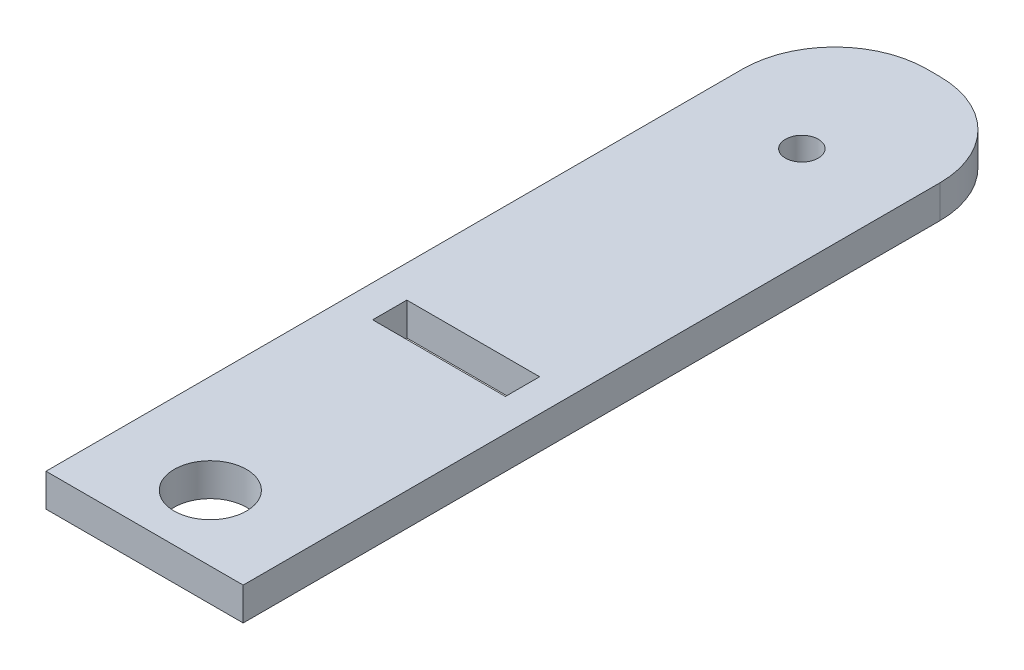
ISO-10303-21;
HEADER;
FILE_DESCRIPTION(('STEP AP214'),'2;1');
FILE_NAME('part.step','',(''),(''),'','','');
FILE_SCHEMA(('AUTOMOTIVE_DESIGN { 1 0 10303 214 1 1 1 1 }'));
ENDSEC;
DATA;
#1=APPLICATION_CONTEXT('core data for automotive mechanical design processes');
#2=APPLICATION_PROTOCOL_DEFINITION('international standard','automotive_design',2000,#1);
#3=PRODUCT_CONTEXT('',#1,'mechanical');
#4=PRODUCT('Part','Part','',(#3));
#5=PRODUCT_RELATED_PRODUCT_CATEGORY('part','',(#4));
#6=PRODUCT_DEFINITION_FORMATION('','',#4);
#7=PRODUCT_DEFINITION_CONTEXT('part definition',#1,'design');
#8=PRODUCT_DEFINITION('design','',#6,#7);
#9=PRODUCT_DEFINITION_SHAPE('','',#8);
#10=(LENGTH_UNIT() NAMED_UNIT(*) SI_UNIT(.MILLI.,.METRE.));
#11=(NAMED_UNIT(*) PLANE_ANGLE_UNIT() SI_UNIT($,.RADIAN.));
#12=(NAMED_UNIT(*) SI_UNIT($,.STERADIAN.) SOLID_ANGLE_UNIT());
#13=UNCERTAINTY_MEASURE_WITH_UNIT(LENGTH_MEASURE(1.E-05),#10,'distance_accuracy_value','');
#14=(GEOMETRIC_REPRESENTATION_CONTEXT(3) GLOBAL_UNCERTAINTY_ASSIGNED_CONTEXT((#13)) GLOBAL_UNIT_ASSIGNED_CONTEXT((#10,
#11,#12)) REPRESENTATION_CONTEXT('',''));
#15=CARTESIAN_POINT('',(0.,0.,0.));
#16=DIRECTION('',(0.,0.,1.));
#17=DIRECTION('',(1.,0.,0.));
#18=AXIS2_PLACEMENT_3D('',#15,#16,#17);
#19=CARTESIAN_POINT('',(-0.635000000000002,3.175,-29.21));
#20=DIRECTION('',(0.,-1.,0.));
#21=DIRECTION('',(0.,0.,-1.));
#22=AXIS2_PLACEMENT_3D('',#19,#20,#21);
#23=CYLINDRICAL_SURFACE('',#22,8.89);
#24=DIRECTION('',(0.,-1.,0.));
#25=VECTOR('',#24,1.);
#26=CARTESIAN_POINT('',(-9.525,3.175,-29.21));
#27=LINE('',#26,#25);
#28=CARTESIAN_POINT('',(-9.525,3.175,-29.21));
#29=VERTEX_POINT('',#28);
#30=CARTESIAN_POINT('',(-9.525,0.,-29.21));
#31=VERTEX_POINT('',#30);
#32=EDGE_CURVE('E197',#29,#31,#27,.T.);
#33=ORIENTED_EDGE('',*,*,#32,.F.);
#34=CARTESIAN_POINT('',(-0.635000000000002,3.175,-29.21));
#35=DIRECTION('',(0.,1.,0.));
#36=DIRECTION('',(0.,0.,1.));
#37=AXIS2_PLACEMENT_3D('',#34,#35,#36);
#38=CIRCLE('',#37,8.89);
#39=CARTESIAN_POINT('',(-0.635000000000005,3.175,-38.1));
#40=VERTEX_POINT('',#39);
#41=EDGE_CURVE('E40',#40,#29,#38,.T.);
#42=ORIENTED_EDGE('',*,*,#41,.F.);
#43=DIRECTION('',(0.,-1.,0.));
#44=VECTOR('',#43,1.);
#45=CARTESIAN_POINT('',(-0.635000000000002,3.175,-38.1));
#46=LINE('',#45,#44);
#47=CARTESIAN_POINT('',(-0.635000000000005,0.,-38.1));
#48=VERTEX_POINT('',#47);
#49=EDGE_CURVE('E200',#48,#40,#46,.F.);
#50=ORIENTED_EDGE('',*,*,#49,.F.);
#51=CARTESIAN_POINT('',(-0.635000000000002,0.,-29.21));
#52=DIRECTION('',(0.,1.,0.));
#53=DIRECTION('',(0.,0.,1.));
#54=AXIS2_PLACEMENT_3D('',#51,#52,#53);
#55=CIRCLE('',#54,8.89);
#56=EDGE_CURVE('E11',#31,#48,#55,.F.);
#57=ORIENTED_EDGE('',*,*,#56,.F.);
#58=EDGE_LOOP('',(#33,#42,#50,#57));
#59=FACE_BOUND('',#58,.T.);
#60=ADVANCED_FACE('F33',(#59),#23,.T.);
#61=CARTESIAN_POINT('',(0.635000000000003,3.175,-29.21));
#62=DIRECTION('',(0.,1.,0.));
#63=DIRECTION('',(0.,0.,1.));
#64=AXIS2_PLACEMENT_3D('',#61,#62,#63);
#65=CYLINDRICAL_SURFACE('',#64,8.89);
#66=DIRECTION('',(0.,1.,0.));
#67=VECTOR('',#66,1.);
#68=CARTESIAN_POINT('',(9.525,3.175,-29.21));
#69=LINE('',#68,#67);
#70=CARTESIAN_POINT('',(9.525,0.,-29.21));
#71=VERTEX_POINT('',#70);
#72=CARTESIAN_POINT('',(9.525,3.175,-29.21));
#73=VERTEX_POINT('',#72);
#74=EDGE_CURVE('E187',#71,#73,#69,.T.);
#75=ORIENTED_EDGE('',*,*,#74,.F.);
#76=CARTESIAN_POINT('',(0.635000000000003,0.,-29.21));
#77=DIRECTION('',(0.,1.,0.));
#78=DIRECTION('',(0.,0.,1.));
#79=AXIS2_PLACEMENT_3D('',#76,#77,#78);
#80=CIRCLE('',#79,8.89);
#81=CARTESIAN_POINT('',(0.634999999999998,0.,-38.1));
#82=VERTEX_POINT('',#81);
#83=EDGE_CURVE('E193',#82,#71,#80,.F.);
#84=ORIENTED_EDGE('',*,*,#83,.F.);
#85=DIRECTION('',(0.,1.,0.));
#86=VECTOR('',#85,1.);
#87=CARTESIAN_POINT('',(0.635000000000002,3.175,-38.1));
#88=LINE('',#87,#86);
#89=CARTESIAN_POINT('',(0.634999999999998,3.175,-38.1));
#90=VERTEX_POINT('',#89);
#91=EDGE_CURVE('E190',#90,#82,#88,.F.);
#92=ORIENTED_EDGE('',*,*,#91,.F.);
#93=CARTESIAN_POINT('',(0.635000000000003,3.175,-29.21));
#94=DIRECTION('',(0.,1.,0.));
#95=DIRECTION('',(0.,0.,1.));
#96=AXIS2_PLACEMENT_3D('',#93,#94,#95);
#97=CIRCLE('',#96,8.89);
#98=EDGE_CURVE('E195',#73,#90,#97,.T.);
#99=ORIENTED_EDGE('',*,*,#98,.F.);
#100=EDGE_LOOP('',(#75,#84,#92,#99));
#101=FACE_BOUND('',#100,.T.);
#102=ADVANCED_FACE('F220',(#101),#65,.T.);
#103=CARTESIAN_POINT('',(0.,3.175,0.));
#104=DIRECTION('',(0.,1.,0.));
#105=DIRECTION('',(0.,0.,1.));
#106=AXIS2_PLACEMENT_3D('',#103,#104,#105);
#107=PLANE('',#106);
#108=CARTESIAN_POINT('',(0.,3.175,31.75));
#109=DIRECTION('',(0.,1.,0.));
#110=DIRECTION('',(0.,0.,1.));
#111=AXIS2_PLACEMENT_3D('',#108,#109,#110);
#112=CIRCLE('',#111,3.4925);
#113=CARTESIAN_POINT('',(0.,3.175,35.2425));
#114=VERTEX_POINT('',#113);
#115=EDGE_CURVE('E150',#114,#114,#112,.T.);
#116=ORIENTED_EDGE('',*,*,#115,.F.);
#117=EDGE_LOOP('',(#116));
#118=FACE_BOUND('',#117,.T.);
#119=DIRECTION('',(-1.,0.,0.));
#120=VECTOR('',#119,1.);
#121=CARTESIAN_POINT('',(-9.525,3.175,-38.1));
#122=LINE('',#121,#120);
#123=EDGE_CURVE('E170',#90,#40,#122,.T.);
#124=ORIENTED_EDGE('',*,*,#123,.T.);
#125=ORIENTED_EDGE('',*,*,#41,.T.);
#126=DIRECTION('',(0.,0.,1.));
#127=VECTOR('',#126,1.);
#128=CARTESIAN_POINT('',(-9.525,3.175,-38.1));
#129=LINE('',#128,#127);
#130=CARTESIAN_POINT('',(-9.525,3.175,38.1));
#131=VERTEX_POINT('',#130);
#132=EDGE_CURVE('E162',#29,#131,#129,.T.);
#133=ORIENTED_EDGE('',*,*,#132,.T.);
#134=DIRECTION('',(1.,0.,0.));
#135=VECTOR('',#134,1.);
#136=CARTESIAN_POINT('',(-9.525,3.175,38.1));
#137=LINE('',#136,#135);
#138=CARTESIAN_POINT('',(9.52500000000001,3.175,38.1));
#139=VERTEX_POINT('',#138);
#140=EDGE_CURVE('E164',#131,#139,#137,.T.);
#141=ORIENTED_EDGE('',*,*,#140,.T.);
#142=DIRECTION('',(0.,0.,-1.));
#143=VECTOR('',#142,1.);
#144=CARTESIAN_POINT('',(9.525,3.175,-38.1));
#145=LINE('',#144,#143);
#146=EDGE_CURVE('E167',#139,#73,#145,.T.);
#147=ORIENTED_EDGE('',*,*,#146,.T.);
#148=ORIENTED_EDGE('',*,*,#98,.T.);
#149=EDGE_LOOP('',(#124,#125,#133,#141,#147,#148));
#150=FACE_BOUND('',#149,.T.);
#151=CARTESIAN_POINT('',(0.,3.175,-25.4));
#152=DIRECTION('',(0.,1.,0.));
#153=DIRECTION('',(0.,0.,1.));
#154=AXIS2_PLACEMENT_3D('',#151,#152,#153);
#155=CIRCLE('',#154,1.5875);
#156=CARTESIAN_POINT('',(0.,3.175,-23.8125));
#157=VERTEX_POINT('',#156);
#158=EDGE_CURVE('E156',#157,#157,#155,.T.);
#159=ORIENTED_EDGE('',*,*,#158,.F.);
#160=EDGE_LOOP('',(#159));
#161=FACE_BOUND('',#160,.T.);
#162=DIRECTION('',(1.,0.,0.));
#163=VECTOR('',#162,1.);
#164=CARTESIAN_POINT('',(-6.4135,3.175,9.652));
#165=LINE('',#164,#163);
#166=CARTESIAN_POINT('',(-6.4135,3.175,9.652));
#167=VERTEX_POINT('',#166);
#168=CARTESIAN_POINT('',(6.4135,3.175,9.652));
#169=VERTEX_POINT('',#168);
#170=EDGE_CURVE('E118',#167,#169,#165,.T.);
#171=ORIENTED_EDGE('',*,*,#170,.F.);
#172=DIRECTION('',(0.,0.,1.));
#173=VECTOR('',#172,1.);
#174=CARTESIAN_POINT('',(-6.4135,3.175,6.35));
#175=LINE('',#174,#173);
#176=CARTESIAN_POINT('',(-6.4135,3.175,6.35));
#177=VERTEX_POINT('',#176);
#178=EDGE_CURVE('E108',#177,#167,#175,.T.);
#179=ORIENTED_EDGE('',*,*,#178,.F.);
#180=DIRECTION('',(-1.,0.,0.));
#181=VECTOR('',#180,1.);
#182=CARTESIAN_POINT('',(-6.4135,3.175,6.35));
#183=LINE('',#182,#181);
#184=CARTESIAN_POINT('',(6.4135,3.175,6.35));
#185=VERTEX_POINT('',#184);
#186=EDGE_CURVE('E134',#185,#177,#183,.T.);
#187=ORIENTED_EDGE('',*,*,#186,.F.);
#188=DIRECTION('',(0.,0.,-1.));
#189=VECTOR('',#188,1.);
#190=CARTESIAN_POINT('',(6.4135,3.175,6.35));
#191=LINE('',#190,#189);
#192=EDGE_CURVE('E132',#169,#185,#191,.T.);
#193=ORIENTED_EDGE('',*,*,#192,.F.);
#194=EDGE_LOOP('',(#171,#179,#187,#193));
#195=FACE_BOUND('',#194,.T.);
#196=ADVANCED_FACE('F130',(#118,#150,#161,#195),#107,.T.);
#197=CARTESIAN_POINT('',(0.,0.,0.));
#198=DIRECTION('',(0.,1.,0.));
#199=DIRECTION('',(0.,0.,1.));
#200=AXIS2_PLACEMENT_3D('',#197,#198,#199);
#201=PLANE('',#200);
#202=CARTESIAN_POINT('',(0.,0.,31.75));
#203=DIRECTION('',(0.,1.,0.));
#204=DIRECTION('',(0.,0.,1.));
#205=AXIS2_PLACEMENT_3D('',#202,#203,#204);
#206=CIRCLE('',#205,3.4925);
#207=CARTESIAN_POINT('',(0.,0.,35.2425));
#208=VERTEX_POINT('',#207);
#209=EDGE_CURVE('E126',#208,#208,#206,.T.);
#210=ORIENTED_EDGE('',*,*,#209,.T.);
#211=EDGE_LOOP('',(#210));
#212=FACE_BOUND('',#211,.T.);
#213=DIRECTION('',(0.,0.,1.));
#214=VECTOR('',#213,1.);
#215=CARTESIAN_POINT('',(-9.525,0.,-38.1));
#216=LINE('',#215,#214);
#217=CARTESIAN_POINT('',(-9.525,0.,38.1));
#218=VERTEX_POINT('',#217);
#219=EDGE_CURVE('E159',#31,#218,#216,.T.);
#220=ORIENTED_EDGE('',*,*,#219,.F.);
#221=ORIENTED_EDGE('',*,*,#56,.T.);
#222=DIRECTION('',(-1.,0.,0.));
#223=VECTOR('',#222,1.);
#224=CARTESIAN_POINT('',(-9.525,0.,-38.1));
#225=LINE('',#224,#223);
#226=EDGE_CURVE('E165',#82,#48,#225,.T.);
#227=ORIENTED_EDGE('',*,*,#226,.F.);
#228=ORIENTED_EDGE('',*,*,#83,.T.);
#229=DIRECTION('',(0.,0.,-1.));
#230=VECTOR('',#229,1.);
#231=CARTESIAN_POINT('',(9.525,0.,-38.1));
#232=LINE('',#231,#230);
#233=CARTESIAN_POINT('',(9.52500000000001,0.,38.1));
#234=VERTEX_POINT('',#233);
#235=EDGE_CURVE('E177',#234,#71,#232,.T.);
#236=ORIENTED_EDGE('',*,*,#235,.F.);
#237=DIRECTION('',(1.,0.,0.));
#238=VECTOR('',#237,1.);
#239=CARTESIAN_POINT('',(-9.525,0.,38.1));
#240=LINE('',#239,#238);
#241=EDGE_CURVE('E175',#218,#234,#240,.T.);
#242=ORIENTED_EDGE('',*,*,#241,.F.);
#243=EDGE_LOOP('',(#220,#221,#227,#228,#236,#242));
#244=FACE_BOUND('',#243,.T.);
#245=CARTESIAN_POINT('',(0.,0.,-25.4));
#246=DIRECTION('',(0.,1.,0.));
#247=DIRECTION('',(0.,0.,1.));
#248=AXIS2_PLACEMENT_3D('',#245,#246,#247);
#249=CIRCLE('',#248,1.5875);
#250=CARTESIAN_POINT('',(0.,0.,-23.8125));
#251=VERTEX_POINT('',#250);
#252=EDGE_CURVE('E153',#251,#251,#249,.T.);
#253=ORIENTED_EDGE('',*,*,#252,.T.);
#254=EDGE_LOOP('',(#253));
#255=FACE_BOUND('',#254,.T.);
#256=DIRECTION('',(0.,0.,1.));
#257=VECTOR('',#256,1.);
#258=CARTESIAN_POINT('',(-6.4135,0.,6.35));
#259=LINE('',#258,#257);
#260=CARTESIAN_POINT('',(-6.4135,0.,6.35));
#261=VERTEX_POINT('',#260);
#262=CARTESIAN_POINT('',(-6.4135,0.,9.652));
#263=VERTEX_POINT('',#262);
#264=EDGE_CURVE('E138',#261,#263,#259,.T.);
#265=ORIENTED_EDGE('',*,*,#264,.T.);
#266=DIRECTION('',(1.,0.,0.));
#267=VECTOR('',#266,1.);
#268=CARTESIAN_POINT('',(-6.4135,0.,9.652));
#269=LINE('',#268,#267);
#270=CARTESIAN_POINT('',(6.4135,0.,9.652));
#271=VERTEX_POINT('',#270);
#272=EDGE_CURVE('E125',#263,#271,#269,.T.);
#273=ORIENTED_EDGE('',*,*,#272,.T.);
#274=DIRECTION('',(0.,0.,-1.));
#275=VECTOR('',#274,1.);
#276=CARTESIAN_POINT('',(6.4135,0.,6.35));
#277=LINE('',#276,#275);
#278=CARTESIAN_POINT('',(6.4135,0.,6.35));
#279=VERTEX_POINT('',#278);
#280=EDGE_CURVE('E141',#271,#279,#277,.T.);
#281=ORIENTED_EDGE('',*,*,#280,.T.);
#282=DIRECTION('',(-1.,0.,0.));
#283=VECTOR('',#282,1.);
#284=CARTESIAN_POINT('',(-6.4135,0.,6.35));
#285=LINE('',#284,#283);
#286=EDGE_CURVE('E119',#279,#261,#285,.T.);
#287=ORIENTED_EDGE('',*,*,#286,.T.);
#288=EDGE_LOOP('',(#265,#273,#281,#287));
#289=FACE_BOUND('',#288,.T.);
#290=ADVANCED_FACE('F223',(#212,#244,#255,#289),#201,.F.);
#291=CARTESIAN_POINT('',(-9.525,3.175,-38.1));
#292=DIRECTION('',(1.,0.,0.));
#293=DIRECTION('',(0.,0.,-1.));
#294=AXIS2_PLACEMENT_3D('',#291,#292,#293);
#295=PLANE('',#294);
#296=ORIENTED_EDGE('',*,*,#132,.F.);
#297=ORIENTED_EDGE('',*,*,#32,.T.);
#298=ORIENTED_EDGE('',*,*,#219,.T.);
#299=DIRECTION('',(0.,-1.,0.));
#300=VECTOR('',#299,1.);
#301=CARTESIAN_POINT('',(-9.525,3.175,38.1));
#302=LINE('',#301,#300);
#303=EDGE_CURVE('E184',#131,#218,#302,.T.);
#304=ORIENTED_EDGE('',*,*,#303,.F.);
#305=EDGE_LOOP('',(#296,#297,#298,#304));
#306=FACE_BOUND('',#305,.T.);
#307=ADVANCED_FACE('F208',(#306),#295,.F.);
#308=CARTESIAN_POINT('',(-9.525,3.175,38.1));
#309=DIRECTION('',(0.,0.,-1.));
#310=DIRECTION('',(-1.,0.,0.));
#311=AXIS2_PLACEMENT_3D('',#308,#309,#310);
#312=PLANE('',#311);
#313=ORIENTED_EDGE('',*,*,#241,.T.);
#314=DIRECTION('',(0.,-1.,0.));
#315=VECTOR('',#314,1.);
#316=CARTESIAN_POINT('',(9.52500000000001,3.175,38.1));
#317=LINE('',#316,#315);
#318=EDGE_CURVE('E173',#139,#234,#317,.T.);
#319=ORIENTED_EDGE('',*,*,#318,.F.);
#320=ORIENTED_EDGE('',*,*,#140,.F.);
#321=ORIENTED_EDGE('',*,*,#303,.T.);
#322=EDGE_LOOP('',(#313,#319,#320,#321));
#323=FACE_BOUND('',#322,.T.);
#324=ADVANCED_FACE('F211',(#323),#312,.F.);
#325=CARTESIAN_POINT('',(9.525,3.175,-38.1));
#326=DIRECTION('',(-1.,0.,0.));
#327=DIRECTION('',(0.,0.,1.));
#328=AXIS2_PLACEMENT_3D('',#325,#326,#327);
#329=PLANE('',#328);
#330=ORIENTED_EDGE('',*,*,#235,.T.);
#331=ORIENTED_EDGE('',*,*,#74,.T.);
#332=ORIENTED_EDGE('',*,*,#146,.F.);
#333=ORIENTED_EDGE('',*,*,#318,.T.);
#334=EDGE_LOOP('',(#330,#331,#332,#333));
#335=FACE_BOUND('',#334,.T.);
#336=ADVANCED_FACE('F216',(#335),#329,.F.);
#337=CARTESIAN_POINT('',(-9.525,3.175,-38.1));
#338=DIRECTION('',(0.,0.,1.));
#339=DIRECTION('',(1.,0.,0.));
#340=AXIS2_PLACEMENT_3D('',#337,#338,#339);
#341=PLANE('',#340);
#342=ORIENTED_EDGE('',*,*,#226,.T.);
#343=ORIENTED_EDGE('',*,*,#49,.T.);
#344=ORIENTED_EDGE('',*,*,#123,.F.);
#345=ORIENTED_EDGE('',*,*,#91,.T.);
#346=EDGE_LOOP('',(#342,#343,#344,#345));
#347=FACE_BOUND('',#346,.T.);
#348=ADVANCED_FACE('F222',(#347),#341,.F.);
#349=CARTESIAN_POINT('',(0.,3.175,-25.4));
#350=DIRECTION('',(0.,-1.,0.));
#351=DIRECTION('',(0.,0.,-1.));
#352=AXIS2_PLACEMENT_3D('',#349,#350,#351);
#353=CYLINDRICAL_SURFACE('',#352,1.5875);
#354=ORIENTED_EDGE('',*,*,#158,.T.);
#355=EDGE_LOOP('',(#354));
#356=FACE_BOUND('',#355,.T.);
#357=ORIENTED_EDGE('',*,*,#252,.F.);
#358=EDGE_LOOP('',(#357));
#359=FACE_BOUND('',#358,.T.);
#360=ADVANCED_FACE('F261',(#356,#359),#353,.F.);
#361=CARTESIAN_POINT('',(0.,3.175,31.75));
#362=DIRECTION('',(0.,-1.,0.));
#363=DIRECTION('',(0.,0.,-1.));
#364=AXIS2_PLACEMENT_3D('',#361,#362,#363);
#365=CYLINDRICAL_SURFACE('',#364,3.4925);
#366=ORIENTED_EDGE('',*,*,#115,.T.);
#367=EDGE_LOOP('',(#366));
#368=FACE_BOUND('',#367,.T.);
#369=ORIENTED_EDGE('',*,*,#209,.F.);
#370=EDGE_LOOP('',(#369));
#371=FACE_BOUND('',#370,.T.);
#372=ADVANCED_FACE('F265',(#368,#371),#365,.F.);
#373=CARTESIAN_POINT('',(-6.4135,3.175,6.35));
#374=DIRECTION('',(1.,0.,0.));
#375=DIRECTION('',(0.,0.,-1.));
#376=AXIS2_PLACEMENT_3D('',#373,#374,#375);
#377=PLANE('',#376);
#378=ORIENTED_EDGE('',*,*,#264,.F.);
#379=DIRECTION('',(0.,-1.,0.));
#380=VECTOR('',#379,1.);
#381=CARTESIAN_POINT('',(-6.4135,3.175,6.35));
#382=LINE('',#381,#380);
#383=EDGE_CURVE('E114',#177,#261,#382,.T.);
#384=ORIENTED_EDGE('',*,*,#383,.F.);
#385=ORIENTED_EDGE('',*,*,#178,.T.);
#386=DIRECTION('',(0.,-1.,0.));
#387=VECTOR('',#386,1.);
#388=CARTESIAN_POINT('',(-6.4135,3.175,9.652));
#389=LINE('',#388,#387);
#390=EDGE_CURVE('E111',#167,#263,#389,.T.);
#391=ORIENTED_EDGE('',*,*,#390,.T.);
#392=EDGE_LOOP('',(#378,#384,#385,#391));
#393=FACE_BOUND('',#392,.T.);
#394=ADVANCED_FACE('F110',(#393),#377,.T.);
#395=CARTESIAN_POINT('',(-6.4135,3.175,9.652));
#396=DIRECTION('',(0.,0.,-1.));
#397=DIRECTION('',(-1.,0.,0.));
#398=AXIS2_PLACEMENT_3D('',#395,#396,#397);
#399=PLANE('',#398);
#400=ORIENTED_EDGE('',*,*,#272,.F.);
#401=ORIENTED_EDGE('',*,*,#390,.F.);
#402=ORIENTED_EDGE('',*,*,#170,.T.);
#403=DIRECTION('',(0.,-1.,0.));
#404=VECTOR('',#403,1.);
#405=CARTESIAN_POINT('',(6.4135,3.175,9.652));
#406=LINE('',#405,#404);
#407=EDGE_CURVE('E127',#169,#271,#406,.T.);
#408=ORIENTED_EDGE('',*,*,#407,.T.);
#409=EDGE_LOOP('',(#400,#401,#402,#408));
#410=FACE_BOUND('',#409,.T.);
#411=ADVANCED_FACE('F122',(#410),#399,.T.);
#412=CARTESIAN_POINT('',(6.4135,3.175,6.35));
#413=DIRECTION('',(-1.,0.,0.));
#414=DIRECTION('',(0.,0.,1.));
#415=AXIS2_PLACEMENT_3D('',#412,#413,#414);
#416=PLANE('',#415);
#417=ORIENTED_EDGE('',*,*,#280,.F.);
#418=ORIENTED_EDGE('',*,*,#407,.F.);
#419=ORIENTED_EDGE('',*,*,#192,.T.);
#420=DIRECTION('',(0.,-1.,0.));
#421=VECTOR('',#420,1.);
#422=CARTESIAN_POINT('',(6.4135,3.175,6.35));
#423=LINE('',#422,#421);
#424=EDGE_CURVE('E147',#185,#279,#423,.T.);
#425=ORIENTED_EDGE('',*,*,#424,.T.);
#426=EDGE_LOOP('',(#417,#418,#419,#425));
#427=FACE_BOUND('',#426,.T.);
#428=ADVANCED_FACE('F235',(#427),#416,.T.);
#429=CARTESIAN_POINT('',(-6.4135,3.175,6.35));
#430=DIRECTION('',(0.,0.,1.));
#431=DIRECTION('',(1.,0.,0.));
#432=AXIS2_PLACEMENT_3D('',#429,#430,#431);
#433=PLANE('',#432);
#434=ORIENTED_EDGE('',*,*,#286,.F.);
#435=ORIENTED_EDGE('',*,*,#424,.F.);
#436=ORIENTED_EDGE('',*,*,#186,.T.);
#437=ORIENTED_EDGE('',*,*,#383,.T.);
#438=EDGE_LOOP('',(#434,#435,#436,#437));
#439=FACE_BOUND('',#438,.T.);
#440=ADVANCED_FACE('F232',(#439),#433,.T.);
#441=CLOSED_SHELL('',(#60,#102,#196,#290,#307,#324,#336,#348,#360,#372,#394,#411,#428,#440));
#442=MANIFOLD_SOLID_BREP('B2',#441);
#443=ADVANCED_BREP_SHAPE_REPRESENTATION('',(#18,#442),#14);
#444=SHAPE_DEFINITION_REPRESENTATION(#9,#443);
ENDSEC;
END-ISO-10303-21;
